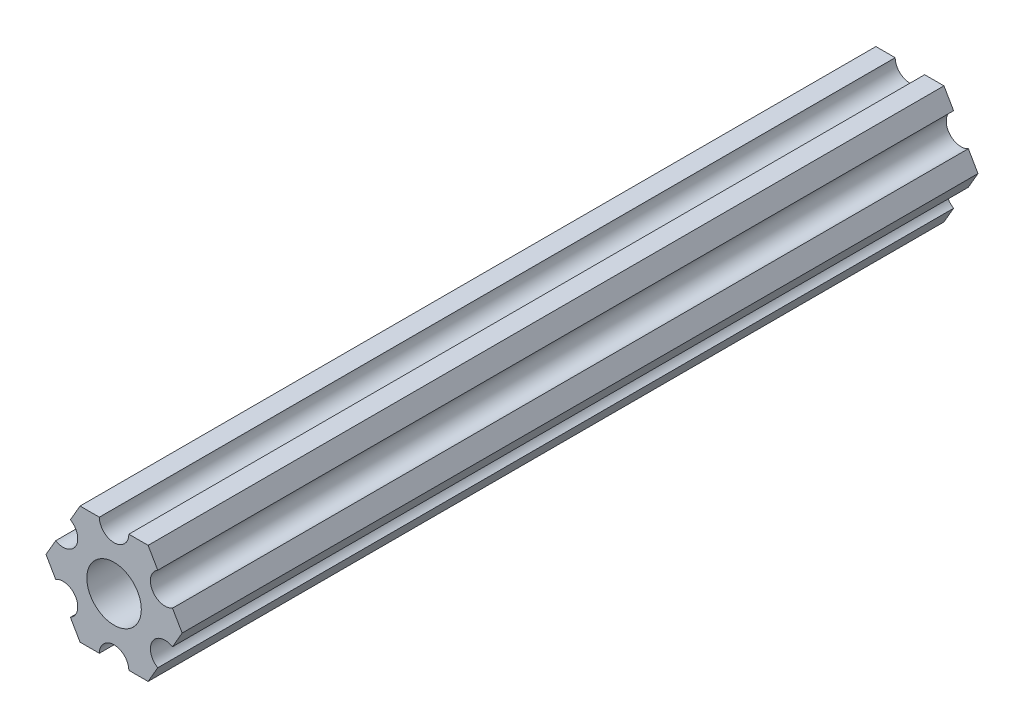
ISO-10303-21;
HEADER;
FILE_DESCRIPTION(('STEP AP214'),'2;1');
FILE_NAME('part.step','',(''),(''),'','','');
FILE_SCHEMA(('AUTOMOTIVE_DESIGN { 1 0 10303 214 1 1 1 1 }'));
ENDSEC;
DATA;
#1=APPLICATION_CONTEXT('core data for automotive mechanical design processes');
#2=APPLICATION_PROTOCOL_DEFINITION('international standard','automotive_design',2000,#1);
#3=PRODUCT_CONTEXT('',#1,'mechanical');
#4=PRODUCT('Part','Part','',(#3));
#5=PRODUCT_RELATED_PRODUCT_CATEGORY('part','',(#4));
#6=PRODUCT_DEFINITION_FORMATION('','',#4);
#7=PRODUCT_DEFINITION_CONTEXT('part definition',#1,'design');
#8=PRODUCT_DEFINITION('design','',#6,#7);
#9=PRODUCT_DEFINITION_SHAPE('','',#8);
#10=(LENGTH_UNIT() NAMED_UNIT(*) SI_UNIT(.MILLI.,.METRE.));
#11=(NAMED_UNIT(*) PLANE_ANGLE_UNIT() SI_UNIT($,.RADIAN.));
#12=(NAMED_UNIT(*) SI_UNIT($,.STERADIAN.) SOLID_ANGLE_UNIT());
#13=UNCERTAINTY_MEASURE_WITH_UNIT(LENGTH_MEASURE(1.E-05),#10,'distance_accuracy_value','');
#14=(GEOMETRIC_REPRESENTATION_CONTEXT(3) GLOBAL_UNCERTAINTY_ASSIGNED_CONTEXT((#13)) GLOBAL_UNIT_ASSIGNED_CONTEXT((#10,
#11,#12)) REPRESENTATION_CONTEXT('',''));
#15=CARTESIAN_POINT('',(0.,0.,0.));
#16=DIRECTION('',(0.,0.,1.));
#17=DIRECTION('',(1.,0.,0.));
#18=AXIS2_PLACEMENT_3D('',#15,#16,#17);
#19=CARTESIAN_POINT('',(5.49926112168156,3.17500033315933,85.725));
#20=DIRECTION('',(0.,0.,1.));
#21=DIRECTION('',(1.,0.,0.));
#22=AXIS2_PLACEMENT_3D('',#19,#20,#21);
#23=PLANE('',#22);
#24=DIRECTION('',(0.499999947533953,0.866025434075723,0.));
#25=VECTOR('',#24,1.);
#26=CARTESIAN_POINT('',(6.29301142309098,-1.80018429024546,85.725));
#27=LINE('',#26,#25);
#28=CARTESIAN_POINT('',(6.29301142309098,-1.80018429024546,85.725));
#29=VERTEX_POINT('',#28);
#30=CARTESIAN_POINT('',(7.33234841870826,4.44212519169686E-07,85.725));
#31=VERTEX_POINT('',#30);
#32=EDGE_CURVE('E226',#29,#31,#27,.T.);
#33=ORIENTED_EDGE('',*,*,#32,.T.);
#34=DIRECTION('',(-0.500000052466056,0.866025373493145,0.));
#35=VECTOR('',#34,1.);
#36=CARTESIAN_POINT('',(7.33234841870826,4.44212519169686E-07,85.725));
#37=LINE('',#36,#35);
#38=CARTESIAN_POINT('',(6.29301120497139,1.80018505273894,85.725));
#39=VERTEX_POINT('',#38);
#40=EDGE_CURVE('E124',#31,#39,#37,.T.);
#41=ORIENTED_EDGE('',*,*,#40,.T.);
#42=CARTESIAN_POINT('',(5.49926112168156,3.17500033315933,85.725));
#43=DIRECTION('',(0.,0.,-1.));
#44=DIRECTION('',(1.,0.,0.));
#45=AXIS2_PLACEMENT_3D('',#42,#43,#44);
#46=CIRCLE('',#45,1.5875);
#47=CARTESIAN_POINT('',(4.70551103839172,4.54981561357972,85.725));
#48=VERTEX_POINT('',#47);
#49=EDGE_CURVE('E271',#39,#48,#46,.T.);
#50=ORIENTED_EDGE('',*,*,#49,.T.);
#51=DIRECTION('',(-0.500000052466046,0.866025373493151,0.));
#52=VECTOR('',#51,1.);
#53=CARTESIAN_POINT('',(4.70551103839172,4.54981561357972,85.725));
#54=LINE('',#53,#52);
#55=CARTESIAN_POINT('',(3.66617382465481,6.35000022210627,85.725));
#56=VERTEX_POINT('',#55);
#57=EDGE_CURVE('E290',#48,#56,#54,.T.);
#58=ORIENTED_EDGE('',*,*,#57,.T.);
#59=DIRECTION('',(-0.999999999999998,-6.05825850611185E-08,0.));
#60=VECTOR('',#59,1.);
#61=CARTESIAN_POINT('',(3.66617382465481,6.35000022210627,85.725));
#62=LINE('',#61,#60);
#63=CARTESIAN_POINT('',(1.58749961530074,6.35000009617482,85.725));
#64=VERTEX_POINT('',#63);
#65=EDGE_CURVE('E287',#56,#64,#62,.T.);
#66=ORIENTED_EDGE('',*,*,#65,.T.);
#67=CARTESIAN_POINT('',(-3.84699260060323E-07,6.35,85.725));
#68=DIRECTION('',(0.,0.,-1.));
#69=DIRECTION('',(1.,0.,0.));
#70=AXIS2_PLACEMENT_3D('',#67,#68,#69);
#71=CIRCLE('',#70,1.5875);
#72=CARTESIAN_POINT('',(-1.58750038469926,6.34999990382518,85.725));
#73=VERTEX_POINT('',#72);
#74=EDGE_CURVE('E289',#64,#73,#71,.T.);
#75=ORIENTED_EDGE('',*,*,#74,.T.);
#76=DIRECTION('',(-0.999999999999998,-6.05825963273174E-08,0.));
#77=VECTOR('',#76,1.);
#78=CARTESIAN_POINT('',(-1.58750038469926,6.34999990382518,85.725));
#79=LINE('',#78,#77);
#80=CARTESIAN_POINT('',(-3.66617459405349,6.3499997778937,85.725));
#81=VERTEX_POINT('',#80);
#82=EDGE_CURVE('E292',#73,#81,#79,.T.);
#83=ORIENTED_EDGE('',*,*,#82,.T.);
#84=DIRECTION('',(-0.499999947533942,-0.866025434075729,0.));
#85=VECTOR('',#84,1.);
#86=CARTESIAN_POINT('',(-3.66617459405349,6.3499997778937,85.725));
#87=LINE('',#86,#85);
#88=CARTESIAN_POINT('',(-4.70551158967065,4.54981504343587,85.725));
#89=VERTEX_POINT('',#88);
#90=EDGE_CURVE('E298',#81,#89,#87,.T.);
#91=ORIENTED_EDGE('',*,*,#90,.T.);
#92=CARTESIAN_POINT('',(-5.49926150638082,3.17499966684067,85.725));
#93=DIRECTION('',(0.,0.,-1.));
#94=DIRECTION('',(1.,0.,0.));
#95=AXIS2_PLACEMENT_3D('',#92,#93,#94);
#96=CIRCLE('',#95,1.5875);
#97=CARTESIAN_POINT('',(-6.29301142309098,1.80018429024547,85.725));
#98=VERTEX_POINT('',#97);
#99=EDGE_CURVE('E300',#89,#98,#96,.T.);
#100=ORIENTED_EDGE('',*,*,#99,.T.);
#101=DIRECTION('',(-0.499999947533951,-0.866025434075724,0.));
#102=VECTOR('',#101,1.);
#103=CARTESIAN_POINT('',(-6.29301142309098,1.80018429024547,85.725));
#104=LINE('',#103,#102);
#105=CARTESIAN_POINT('',(-7.33234841870826,-4.44212523790841E-07,85.725));
#106=VERTEX_POINT('',#105);
#107=EDGE_CURVE('E302',#98,#106,#104,.T.);
#108=ORIENTED_EDGE('',*,*,#107,.T.);
#109=DIRECTION('',(0.500000052466045,-0.866025373493151,0.));
#110=VECTOR('',#109,1.);
#111=CARTESIAN_POINT('',(-7.33234841870826,-4.44212523790841E-07,85.725));
#112=LINE('',#111,#110);
#113=CARTESIAN_POINT('',(-6.29301120497141,-1.80018505273897,85.725));
#114=VERTEX_POINT('',#113);
#115=EDGE_CURVE('E304',#106,#114,#112,.T.);
#116=ORIENTED_EDGE('',*,*,#115,.T.);
#117=CARTESIAN_POINT('',(-5.49926112168156,-3.17500033315934,85.725));
#118=DIRECTION('',(0.,0.,-1.));
#119=DIRECTION('',(1.,0.,0.));
#120=AXIS2_PLACEMENT_3D('',#117,#118,#119);
#121=CIRCLE('',#120,1.5875);
#122=CARTESIAN_POINT('',(-4.70551103839172,-4.54981561357972,85.725));
#123=VERTEX_POINT('',#122);
#124=EDGE_CURVE('E306',#114,#123,#121,.T.);
#125=ORIENTED_EDGE('',*,*,#124,.T.);
#126=DIRECTION('',(0.500000052466045,-0.866025373493151,0.));
#127=VECTOR('',#126,1.);
#128=CARTESIAN_POINT('',(-4.70551103839172,-4.54981561357972,85.725));
#129=LINE('',#128,#127);
#130=CARTESIAN_POINT('',(-3.66617382465481,-6.35000022210628,85.725));
#131=VERTEX_POINT('',#130);
#132=EDGE_CURVE('E308',#123,#131,#129,.T.);
#133=ORIENTED_EDGE('',*,*,#132,.T.);
#134=DIRECTION('',(0.999999999999998,6.05825854783851E-08,0.));
#135=VECTOR('',#134,1.);
#136=CARTESIAN_POINT('',(-3.66617382465481,-6.35000022210628,85.725));
#137=LINE('',#136,#135);
#138=CARTESIAN_POINT('',(-1.58749961530074,-6.35000009617482,85.725));
#139=VERTEX_POINT('',#138);
#140=EDGE_CURVE('E310',#131,#139,#137,.T.);
#141=ORIENTED_EDGE('',*,*,#140,.T.);
#142=CARTESIAN_POINT('',(3.8469926204343E-07,-6.35,85.725));
#143=DIRECTION('',(0.,0.,-1.));
#144=DIRECTION('',(1.,0.,0.));
#145=AXIS2_PLACEMENT_3D('',#142,#143,#144);
#146=CIRCLE('',#145,1.5875);
#147=CARTESIAN_POINT('',(1.58750038469926,-6.34999990382518,85.725));
#148=VERTEX_POINT('',#147);
#149=EDGE_CURVE('E173',#139,#148,#146,.T.);
#150=ORIENTED_EDGE('',*,*,#149,.T.);
#151=DIRECTION('',(0.999999999999998,6.05825721258438E-08,0.));
#152=VECTOR('',#151,1.);
#153=CARTESIAN_POINT('',(1.58750038469926,-6.34999990382518,85.725));
#154=LINE('',#153,#152);
#155=CARTESIAN_POINT('',(3.66617459405346,-6.34999977789375,85.725));
#156=VERTEX_POINT('',#155);
#157=EDGE_CURVE('E167',#148,#156,#154,.T.);
#158=ORIENTED_EDGE('',*,*,#157,.T.);
#159=DIRECTION('',(0.499999947533941,0.86602543407573,0.));
#160=VECTOR('',#159,1.);
#161=CARTESIAN_POINT('',(3.66617459405346,-6.34999977789375,85.725));
#162=LINE('',#161,#160);
#163=CARTESIAN_POINT('',(4.70551158967065,-4.54981504343587,85.725));
#164=VERTEX_POINT('',#163);
#165=EDGE_CURVE('E171',#156,#164,#162,.T.);
#166=ORIENTED_EDGE('',*,*,#165,.T.);
#167=CARTESIAN_POINT('',(5.49926150638082,-3.17499966684067,85.725));
#168=DIRECTION('',(0.,0.,-1.));
#169=DIRECTION('',(1.,0.,0.));
#170=AXIS2_PLACEMENT_3D('',#167,#168,#169);
#171=CIRCLE('',#170,1.58750000000001);
#172=EDGE_CURVE('E51',#164,#29,#171,.T.);
#173=ORIENTED_EDGE('',*,*,#172,.T.);
#174=EDGE_LOOP('',(#33,#41,#50,#58,#66,#75,#83,#91,#100,#108,#116,#125,#133,#141,#150,#158,#166,#173));
#175=FACE_BOUND('',#174,.T.);
#176=CARTESIAN_POINT('',(0.,0.,85.725));
#177=DIRECTION('',(0.,0.,1.));
#178=DIRECTION('',(1.,0.,0.));
#179=AXIS2_PLACEMENT_3D('',#176,#177,#178);
#180=CIRCLE('',#179,2.9337);
#181=CARTESIAN_POINT('',(2.9337,0.,85.725));
#182=VERTEX_POINT('',#181);
#183=EDGE_CURVE('E195',#182,#182,#180,.T.);
#184=ORIENTED_EDGE('',*,*,#183,.F.);
#185=EDGE_LOOP('',(#184));
#186=FACE_BOUND('',#185,.T.);
#187=ADVANCED_FACE('F34',(#175,#186),#23,.T.);
#188=CARTESIAN_POINT('',(5.49926112168156,3.17500033315933,0.));
#189=DIRECTION('',(0.,0.,1.));
#190=DIRECTION('',(1.,0.,0.));
#191=AXIS2_PLACEMENT_3D('',#188,#189,#190);
#192=PLANE('',#191);
#193=DIRECTION('',(0.499999947533953,0.866025434075723,0.));
#194=VECTOR('',#193,1.);
#195=CARTESIAN_POINT('',(6.29301142309098,-1.80018429024546,0.));
#196=LINE('',#195,#194);
#197=CARTESIAN_POINT('',(6.29301142309098,-1.80018429024546,0.));
#198=VERTEX_POINT('',#197);
#199=CARTESIAN_POINT('',(7.33234841870826,4.44212519169686E-07,0.));
#200=VERTEX_POINT('',#199);
#201=EDGE_CURVE('E191',#198,#200,#196,.T.);
#202=ORIENTED_EDGE('',*,*,#201,.F.);
#203=CARTESIAN_POINT('',(5.49926150638082,-3.17499966684067,0.));
#204=DIRECTION('',(0.,0.,-1.));
#205=DIRECTION('',(1.,0.,0.));
#206=AXIS2_PLACEMENT_3D('',#203,#204,#205);
#207=CIRCLE('',#206,1.58750000000001);
#208=CARTESIAN_POINT('',(4.70551158967065,-4.54981504343587,0.));
#209=VERTEX_POINT('',#208);
#210=EDGE_CURVE('E116',#209,#198,#207,.T.);
#211=ORIENTED_EDGE('',*,*,#210,.F.);
#212=DIRECTION('',(0.499999947533941,0.86602543407573,0.));
#213=VECTOR('',#212,1.);
#214=CARTESIAN_POINT('',(3.66617459405346,-6.34999977789375,0.));
#215=LINE('',#214,#213);
#216=CARTESIAN_POINT('',(3.66617459405346,-6.34999977789375,0.));
#217=VERTEX_POINT('',#216);
#218=EDGE_CURVE('E110',#217,#209,#215,.T.);
#219=ORIENTED_EDGE('',*,*,#218,.F.);
#220=DIRECTION('',(0.999999999999998,6.05825721258438E-08,0.));
#221=VECTOR('',#220,1.);
#222=CARTESIAN_POINT('',(1.58750038469926,-6.34999990382518,0.));
#223=LINE('',#222,#221);
#224=CARTESIAN_POINT('',(1.58750038469926,-6.34999990382518,0.));
#225=VERTEX_POINT('',#224);
#226=EDGE_CURVE('E181',#225,#217,#223,.T.);
#227=ORIENTED_EDGE('',*,*,#226,.F.);
#228=CARTESIAN_POINT('',(3.8469926204343E-07,-6.35,0.));
#229=DIRECTION('',(0.,0.,-1.));
#230=DIRECTION('',(1.,0.,0.));
#231=AXIS2_PLACEMENT_3D('',#228,#229,#230);
#232=CIRCLE('',#231,1.5875);
#233=CARTESIAN_POINT('',(-1.58749961530074,-6.35000009617482,0.));
#234=VERTEX_POINT('',#233);
#235=EDGE_CURVE('E221',#234,#225,#232,.T.);
#236=ORIENTED_EDGE('',*,*,#235,.F.);
#237=DIRECTION('',(0.999999999999998,6.05825854783851E-08,0.));
#238=VECTOR('',#237,1.);
#239=CARTESIAN_POINT('',(-3.66617382465481,-6.35000022210628,0.));
#240=LINE('',#239,#238);
#241=CARTESIAN_POINT('',(-3.66617382465481,-6.35000022210628,0.));
#242=VERTEX_POINT('',#241);
#243=EDGE_CURVE('E219',#242,#234,#240,.T.);
#244=ORIENTED_EDGE('',*,*,#243,.F.);
#245=DIRECTION('',(0.500000052466045,-0.866025373493151,0.));
#246=VECTOR('',#245,1.);
#247=CARTESIAN_POINT('',(-4.70551103839172,-4.54981561357972,0.));
#248=LINE('',#247,#246);
#249=CARTESIAN_POINT('',(-4.70551103839172,-4.54981561357972,0.));
#250=VERTEX_POINT('',#249);
#251=EDGE_CURVE('E217',#250,#242,#248,.T.);
#252=ORIENTED_EDGE('',*,*,#251,.F.);
#253=CARTESIAN_POINT('',(-5.49926112168156,-3.17500033315934,0.));
#254=DIRECTION('',(0.,0.,-1.));
#255=DIRECTION('',(1.,0.,0.));
#256=AXIS2_PLACEMENT_3D('',#253,#254,#255);
#257=CIRCLE('',#256,1.5875);
#258=CARTESIAN_POINT('',(-6.29301120497141,-1.80018505273897,0.));
#259=VERTEX_POINT('',#258);
#260=EDGE_CURVE('E215',#259,#250,#257,.T.);
#261=ORIENTED_EDGE('',*,*,#260,.F.);
#262=DIRECTION('',(0.500000052466045,-0.866025373493151,0.));
#263=VECTOR('',#262,1.);
#264=CARTESIAN_POINT('',(-7.33234841870826,-4.44212523790841E-07,0.));
#265=LINE('',#264,#263);
#266=CARTESIAN_POINT('',(-7.33234841870826,-4.44212523790841E-07,0.));
#267=VERTEX_POINT('',#266);
#268=EDGE_CURVE('E213',#267,#259,#265,.T.);
#269=ORIENTED_EDGE('',*,*,#268,.F.);
#270=DIRECTION('',(-0.499999947533951,-0.866025434075724,0.));
#271=VECTOR('',#270,1.);
#272=CARTESIAN_POINT('',(-6.29301142309098,1.80018429024547,0.));
#273=LINE('',#272,#271);
#274=CARTESIAN_POINT('',(-6.29301142309098,1.80018429024547,0.));
#275=VERTEX_POINT('',#274);
#276=EDGE_CURVE('E211',#275,#267,#273,.T.);
#277=ORIENTED_EDGE('',*,*,#276,.F.);
#278=CARTESIAN_POINT('',(-5.49926150638082,3.17499966684067,0.));
#279=DIRECTION('',(0.,0.,-1.));
#280=DIRECTION('',(1.,0.,0.));
#281=AXIS2_PLACEMENT_3D('',#278,#279,#280);
#282=CIRCLE('',#281,1.5875);
#283=CARTESIAN_POINT('',(-4.70551158967065,4.54981504343587,0.));
#284=VERTEX_POINT('',#283);
#285=EDGE_CURVE('E209',#284,#275,#282,.T.);
#286=ORIENTED_EDGE('',*,*,#285,.F.);
#287=DIRECTION('',(-0.499999947533942,-0.866025434075729,0.));
#288=VECTOR('',#287,1.);
#289=CARTESIAN_POINT('',(-3.66617459405349,6.3499997778937,0.));
#290=LINE('',#289,#288);
#291=CARTESIAN_POINT('',(-3.66617459405349,6.3499997778937,0.));
#292=VERTEX_POINT('',#291);
#293=EDGE_CURVE('E207',#292,#284,#290,.T.);
#294=ORIENTED_EDGE('',*,*,#293,.F.);
#295=DIRECTION('',(-0.999999999999998,-6.05825963273174E-08,0.));
#296=VECTOR('',#295,1.);
#297=CARTESIAN_POINT('',(-1.58750038469926,6.34999990382518,0.));
#298=LINE('',#297,#296);
#299=CARTESIAN_POINT('',(-1.58750038469926,6.34999990382518,0.));
#300=VERTEX_POINT('',#299);
#301=EDGE_CURVE('E205',#300,#292,#298,.T.);
#302=ORIENTED_EDGE('',*,*,#301,.F.);
#303=CARTESIAN_POINT('',(-3.84699260060323E-07,6.35,0.));
#304=DIRECTION('',(0.,0.,-1.));
#305=DIRECTION('',(1.,0.,0.));
#306=AXIS2_PLACEMENT_3D('',#303,#304,#305);
#307=CIRCLE('',#306,1.5875);
#308=CARTESIAN_POINT('',(1.58749961530074,6.35000009617482,0.));
#309=VERTEX_POINT('',#308);
#310=EDGE_CURVE('E203',#309,#300,#307,.T.);
#311=ORIENTED_EDGE('',*,*,#310,.F.);
#312=DIRECTION('',(-0.999999999999998,-6.05825850611185E-08,0.));
#313=VECTOR('',#312,1.);
#314=CARTESIAN_POINT('',(3.66617382465481,6.35000022210627,0.));
#315=LINE('',#314,#313);
#316=CARTESIAN_POINT('',(3.66617382465481,6.35000022210627,0.));
#317=VERTEX_POINT('',#316);
#318=EDGE_CURVE('E201',#317,#309,#315,.T.);
#319=ORIENTED_EDGE('',*,*,#318,.F.);
#320=DIRECTION('',(-0.500000052466046,0.866025373493151,0.));
#321=VECTOR('',#320,1.);
#322=CARTESIAN_POINT('',(4.70551103839172,4.54981561357972,0.));
#323=LINE('',#322,#321);
#324=CARTESIAN_POINT('',(4.70551103839172,4.54981561357972,0.));
#325=VERTEX_POINT('',#324);
#326=EDGE_CURVE('E199',#325,#317,#323,.T.);
#327=ORIENTED_EDGE('',*,*,#326,.F.);
#328=CARTESIAN_POINT('',(5.49926112168156,3.17500033315933,0.));
#329=DIRECTION('',(0.,0.,-1.));
#330=DIRECTION('',(1.,0.,0.));
#331=AXIS2_PLACEMENT_3D('',#328,#329,#330);
#332=CIRCLE('',#331,1.5875);
#333=CARTESIAN_POINT('',(6.29301120497139,1.80018505273894,0.));
#334=VERTEX_POINT('',#333);
#335=EDGE_CURVE('E197',#334,#325,#332,.T.);
#336=ORIENTED_EDGE('',*,*,#335,.F.);
#337=DIRECTION('',(-0.500000052466056,0.866025373493145,0.));
#338=VECTOR('',#337,1.);
#339=CARTESIAN_POINT('',(7.33234841870826,4.44212519169686E-07,0.));
#340=LINE('',#339,#338);
#341=EDGE_CURVE('E194',#200,#334,#340,.T.);
#342=ORIENTED_EDGE('',*,*,#341,.F.);
#343=EDGE_LOOP('',(#202,#211,#219,#227,#236,#244,#252,#261,#269,#277,#286,#294,#302,#311,#319,
#327,#336,#342));
#344=FACE_BOUND('',#343,.T.);
#345=CARTESIAN_POINT('',(0.,0.,0.));
#346=DIRECTION('',(0.,0.,1.));
#347=DIRECTION('',(1.,0.,0.));
#348=AXIS2_PLACEMENT_3D('',#345,#346,#347);
#349=CIRCLE('',#348,2.9337);
#350=CARTESIAN_POINT('',(2.9337,0.,0.));
#351=VERTEX_POINT('',#350);
#352=EDGE_CURVE('E535',#351,#351,#349,.T.);
#353=ORIENTED_EDGE('',*,*,#352,.T.);
#354=EDGE_LOOP('',(#353));
#355=FACE_BOUND('',#354,.T.);
#356=ADVANCED_FACE('F275',(#344,#355),#192,.F.);
#357=CARTESIAN_POINT('',(6.29301142309098,-1.80018429024546,85.725));
#358=DIRECTION('',(-0.866025434075723,0.499999947533953,0.));
#359=DIRECTION('',(-0.499999947533953,-0.866025434075723,0.));
#360=AXIS2_PLACEMENT_3D('',#357,#358,#359);
#361=PLANE('',#360);
#362=ORIENTED_EDGE('',*,*,#201,.T.);
#363=DIRECTION('',(0.,0.,-1.));
#364=VECTOR('',#363,1.);
#365=CARTESIAN_POINT('',(7.33234841870826,4.44212519169686E-07,85.725));
#366=LINE('',#365,#364);
#367=EDGE_CURVE('E11',#31,#200,#366,.T.);
#368=ORIENTED_EDGE('',*,*,#367,.F.);
#369=ORIENTED_EDGE('',*,*,#32,.F.);
#370=DIRECTION('',(0.,0.,-1.));
#371=VECTOR('',#370,1.);
#372=CARTESIAN_POINT('',(6.29301142309098,-1.80018429024546,85.725));
#373=LINE('',#372,#371);
#374=EDGE_CURVE('E187',#29,#198,#373,.T.);
#375=ORIENTED_EDGE('',*,*,#374,.T.);
#376=EDGE_LOOP('',(#362,#368,#369,#375));
#377=FACE_BOUND('',#376,.T.);
#378=ADVANCED_FACE('F36',(#377),#361,.F.);
#379=CARTESIAN_POINT('',(7.33234841870826,4.44212519169686E-07,85.725));
#380=DIRECTION('',(-0.866025373493145,-0.500000052466056,0.));
#381=DIRECTION('',(0.500000052466056,-0.866025373493145,0.));
#382=AXIS2_PLACEMENT_3D('',#379,#380,#381);
#383=PLANE('',#382);
#384=ORIENTED_EDGE('',*,*,#341,.T.);
#385=DIRECTION('',(0.,0.,-1.));
#386=VECTOR('',#385,1.);
#387=CARTESIAN_POINT('',(6.29301120497139,1.80018505273894,85.725));
#388=LINE('',#387,#386);
#389=EDGE_CURVE('E43',#39,#334,#388,.T.);
#390=ORIENTED_EDGE('',*,*,#389,.F.);
#391=ORIENTED_EDGE('',*,*,#40,.F.);
#392=ORIENTED_EDGE('',*,*,#367,.T.);
#393=EDGE_LOOP('',(#384,#390,#391,#392));
#394=FACE_BOUND('',#393,.T.);
#395=ADVANCED_FACE('F344',(#394),#383,.F.);
#396=CARTESIAN_POINT('',(5.49926112168156,3.17500033315933,85.725));
#397=DIRECTION('',(0.,0.,-1.));
#398=DIRECTION('',(-1.,0.,0.));
#399=AXIS2_PLACEMENT_3D('',#396,#397,#398);
#400=CYLINDRICAL_SURFACE('',#399,1.5875);
#401=ORIENTED_EDGE('',*,*,#335,.T.);
#402=DIRECTION('',(0.,0.,-1.));
#403=VECTOR('',#402,1.);
#404=CARTESIAN_POINT('',(4.70551103839172,4.54981561357972,85.725));
#405=LINE('',#404,#403);
#406=EDGE_CURVE('E263',#48,#325,#405,.T.);
#407=ORIENTED_EDGE('',*,*,#406,.F.);
#408=ORIENTED_EDGE('',*,*,#49,.F.);
#409=ORIENTED_EDGE('',*,*,#389,.T.);
#410=EDGE_LOOP('',(#401,#407,#408,#409));
#411=FACE_BOUND('',#410,.T.);
#412=ADVANCED_FACE('F269',(#411),#400,.F.);
#413=CARTESIAN_POINT('',(4.70551103839172,4.54981561357972,85.725));
#414=DIRECTION('',(-0.866025373493151,-0.500000052466046,0.));
#415=DIRECTION('',(0.500000052466046,-0.866025373493151,0.));
#416=AXIS2_PLACEMENT_3D('',#413,#414,#415);
#417=PLANE('',#416);
#418=ORIENTED_EDGE('',*,*,#326,.T.);
#419=DIRECTION('',(0.,0.,-1.));
#420=VECTOR('',#419,1.);
#421=CARTESIAN_POINT('',(3.66617382465481,6.35000022210627,85.725));
#422=LINE('',#421,#420);
#423=EDGE_CURVE('E260',#56,#317,#422,.T.);
#424=ORIENTED_EDGE('',*,*,#423,.F.);
#425=ORIENTED_EDGE('',*,*,#57,.F.);
#426=ORIENTED_EDGE('',*,*,#406,.T.);
#427=EDGE_LOOP('',(#418,#424,#425,#426));
#428=FACE_BOUND('',#427,.T.);
#429=ADVANCED_FACE('F281',(#428),#417,.F.);
#430=CARTESIAN_POINT('',(3.66617382465481,6.35000022210627,85.725));
#431=DIRECTION('',(6.05825850611185E-08,-0.999999999999998,0.));
#432=DIRECTION('',(0.999999999999998,6.05825850611185E-08,0.));
#433=AXIS2_PLACEMENT_3D('',#430,#431,#432);
#434=PLANE('',#433);
#435=ORIENTED_EDGE('',*,*,#318,.T.);
#436=DIRECTION('',(0.,0.,-1.));
#437=VECTOR('',#436,1.);
#438=CARTESIAN_POINT('',(1.58749961530074,6.35000009617482,85.725));
#439=LINE('',#438,#437);
#440=EDGE_CURVE('E257',#64,#309,#439,.T.);
#441=ORIENTED_EDGE('',*,*,#440,.F.);
#442=ORIENTED_EDGE('',*,*,#65,.F.);
#443=ORIENTED_EDGE('',*,*,#423,.T.);
#444=EDGE_LOOP('',(#435,#441,#442,#443));
#445=FACE_BOUND('',#444,.T.);
#446=ADVANCED_FACE('F285',(#445),#434,.F.);
#447=CARTESIAN_POINT('',(-3.84699260060323E-07,6.35,85.725));
#448=DIRECTION('',(0.,0.,-1.));
#449=DIRECTION('',(-1.,0.,0.));
#450=AXIS2_PLACEMENT_3D('',#447,#448,#449);
#451=CYLINDRICAL_SURFACE('',#450,1.5875);
#452=ORIENTED_EDGE('',*,*,#310,.T.);
#453=DIRECTION('',(0.,0.,-1.));
#454=VECTOR('',#453,1.);
#455=CARTESIAN_POINT('',(-1.58750038469926,6.34999990382518,85.725));
#456=LINE('',#455,#454);
#457=EDGE_CURVE('E254',#73,#300,#456,.T.);
#458=ORIENTED_EDGE('',*,*,#457,.F.);
#459=ORIENTED_EDGE('',*,*,#74,.F.);
#460=ORIENTED_EDGE('',*,*,#440,.T.);
#461=EDGE_LOOP('',(#452,#458,#459,#460));
#462=FACE_BOUND('',#461,.T.);
#463=ADVANCED_FACE('F357',(#462),#451,.F.);
#464=CARTESIAN_POINT('',(-1.58750038469926,6.34999990382518,85.725));
#465=DIRECTION('',(6.05825963273174E-08,-0.999999999999998,0.));
#466=DIRECTION('',(0.999999999999998,6.05825963273174E-08,0.));
#467=AXIS2_PLACEMENT_3D('',#464,#465,#466);
#468=PLANE('',#467);
#469=ORIENTED_EDGE('',*,*,#301,.T.);
#470=DIRECTION('',(0.,0.,-1.));
#471=VECTOR('',#470,1.);
#472=CARTESIAN_POINT('',(-3.66617459405349,6.3499997778937,85.725));
#473=LINE('',#472,#471);
#474=EDGE_CURVE('E251',#81,#292,#473,.T.);
#475=ORIENTED_EDGE('',*,*,#474,.F.);
#476=ORIENTED_EDGE('',*,*,#82,.F.);
#477=ORIENTED_EDGE('',*,*,#457,.T.);
#478=EDGE_LOOP('',(#469,#475,#476,#477));
#479=FACE_BOUND('',#478,.T.);
#480=ADVANCED_FACE('F360',(#479),#468,.F.);
#481=CARTESIAN_POINT('',(-3.66617459405349,6.3499997778937,85.725));
#482=DIRECTION('',(0.866025434075729,-0.499999947533942,0.));
#483=DIRECTION('',(0.499999947533942,0.866025434075729,0.));
#484=AXIS2_PLACEMENT_3D('',#481,#482,#483);
#485=PLANE('',#484);
#486=ORIENTED_EDGE('',*,*,#293,.T.);
#487=DIRECTION('',(0.,0.,-1.));
#488=VECTOR('',#487,1.);
#489=CARTESIAN_POINT('',(-4.70551158967065,4.54981504343587,85.725));
#490=LINE('',#489,#488);
#491=EDGE_CURVE('E248',#89,#284,#490,.T.);
#492=ORIENTED_EDGE('',*,*,#491,.F.);
#493=ORIENTED_EDGE('',*,*,#90,.F.);
#494=ORIENTED_EDGE('',*,*,#474,.T.);
#495=EDGE_LOOP('',(#486,#492,#493,#494));
#496=FACE_BOUND('',#495,.T.);
#497=ADVANCED_FACE('F364',(#496),#485,.F.);
#498=CARTESIAN_POINT('',(-5.49926150638082,3.17499966684067,85.725));
#499=DIRECTION('',(0.,0.,-1.));
#500=DIRECTION('',(-1.,0.,0.));
#501=AXIS2_PLACEMENT_3D('',#498,#499,#500);
#502=CYLINDRICAL_SURFACE('',#501,1.5875);
#503=ORIENTED_EDGE('',*,*,#285,.T.);
#504=DIRECTION('',(0.,0.,-1.));
#505=VECTOR('',#504,1.);
#506=CARTESIAN_POINT('',(-6.29301142309098,1.80018429024547,85.725));
#507=LINE('',#506,#505);
#508=EDGE_CURVE('E245',#98,#275,#507,.T.);
#509=ORIENTED_EDGE('',*,*,#508,.F.);
#510=ORIENTED_EDGE('',*,*,#99,.F.);
#511=ORIENTED_EDGE('',*,*,#491,.T.);
#512=EDGE_LOOP('',(#503,#509,#510,#511));
#513=FACE_BOUND('',#512,.T.);
#514=ADVANCED_FACE('F368',(#513),#502,.F.);
#515=CARTESIAN_POINT('',(-6.29301142309098,1.80018429024547,85.725));
#516=DIRECTION('',(0.866025434075724,-0.499999947533951,0.));
#517=DIRECTION('',(0.499999947533951,0.866025434075724,0.));
#518=AXIS2_PLACEMENT_3D('',#515,#516,#517);
#519=PLANE('',#518);
#520=ORIENTED_EDGE('',*,*,#276,.T.);
#521=DIRECTION('',(0.,0.,-1.));
#522=VECTOR('',#521,1.);
#523=CARTESIAN_POINT('',(-7.33234841870826,-4.44212523790841E-07,85.725));
#524=LINE('',#523,#522);
#525=EDGE_CURVE('E242',#106,#267,#524,.T.);
#526=ORIENTED_EDGE('',*,*,#525,.F.);
#527=ORIENTED_EDGE('',*,*,#107,.F.);
#528=ORIENTED_EDGE('',*,*,#508,.T.);
#529=EDGE_LOOP('',(#520,#526,#527,#528));
#530=FACE_BOUND('',#529,.T.);
#531=ADVANCED_FACE('F372',(#530),#519,.F.);
#532=CARTESIAN_POINT('',(-7.33234841870826,-4.44212523790841E-07,85.725));
#533=DIRECTION('',(0.866025373493151,0.500000052466045,0.));
#534=DIRECTION('',(-0.500000052466045,0.866025373493151,0.));
#535=AXIS2_PLACEMENT_3D('',#532,#533,#534);
#536=PLANE('',#535);
#537=ORIENTED_EDGE('',*,*,#268,.T.);
#538=DIRECTION('',(0.,0.,-1.));
#539=VECTOR('',#538,1.);
#540=CARTESIAN_POINT('',(-6.29301120497141,-1.80018505273897,85.725));
#541=LINE('',#540,#539);
#542=EDGE_CURVE('E239',#114,#259,#541,.T.);
#543=ORIENTED_EDGE('',*,*,#542,.F.);
#544=ORIENTED_EDGE('',*,*,#115,.F.);
#545=ORIENTED_EDGE('',*,*,#525,.T.);
#546=EDGE_LOOP('',(#537,#543,#544,#545));
#547=FACE_BOUND('',#546,.T.);
#548=ADVANCED_FACE('F376',(#547),#536,.F.);
#549=CARTESIAN_POINT('',(-5.49926112168156,-3.17500033315934,85.725));
#550=DIRECTION('',(0.,0.,-1.));
#551=DIRECTION('',(-1.,0.,0.));
#552=AXIS2_PLACEMENT_3D('',#549,#550,#551);
#553=CYLINDRICAL_SURFACE('',#552,1.5875);
#554=ORIENTED_EDGE('',*,*,#260,.T.);
#555=DIRECTION('',(0.,0.,-1.));
#556=VECTOR('',#555,1.);
#557=CARTESIAN_POINT('',(-4.70551103839172,-4.54981561357972,85.725));
#558=LINE('',#557,#556);
#559=EDGE_CURVE('E236',#123,#250,#558,.T.);
#560=ORIENTED_EDGE('',*,*,#559,.F.);
#561=ORIENTED_EDGE('',*,*,#124,.F.);
#562=ORIENTED_EDGE('',*,*,#542,.T.);
#563=EDGE_LOOP('',(#554,#560,#561,#562));
#564=FACE_BOUND('',#563,.T.);
#565=ADVANCED_FACE('F380',(#564),#553,.F.);
#566=CARTESIAN_POINT('',(-4.70551103839172,-4.54981561357972,85.725));
#567=DIRECTION('',(0.866025373493151,0.500000052466045,0.));
#568=DIRECTION('',(-0.500000052466045,0.866025373493151,0.));
#569=AXIS2_PLACEMENT_3D('',#566,#567,#568);
#570=PLANE('',#569);
#571=ORIENTED_EDGE('',*,*,#251,.T.);
#572=DIRECTION('',(0.,0.,-1.));
#573=VECTOR('',#572,1.);
#574=CARTESIAN_POINT('',(-3.66617382465481,-6.35000022210628,85.725));
#575=LINE('',#574,#573);
#576=EDGE_CURVE('E233',#131,#242,#575,.T.);
#577=ORIENTED_EDGE('',*,*,#576,.F.);
#578=ORIENTED_EDGE('',*,*,#132,.F.);
#579=ORIENTED_EDGE('',*,*,#559,.T.);
#580=EDGE_LOOP('',(#571,#577,#578,#579));
#581=FACE_BOUND('',#580,.T.);
#582=ADVANCED_FACE('F384',(#581),#570,.F.);
#583=CARTESIAN_POINT('',(-3.66617382465481,-6.35000022210628,85.725));
#584=DIRECTION('',(-6.05825854783851E-08,0.999999999999998,0.));
#585=DIRECTION('',(-0.999999999999998,-6.05825854783851E-08,0.));
#586=AXIS2_PLACEMENT_3D('',#583,#584,#585);
#587=PLANE('',#586);
#588=ORIENTED_EDGE('',*,*,#243,.T.);
#589=DIRECTION('',(0.,0.,-1.));
#590=VECTOR('',#589,1.);
#591=CARTESIAN_POINT('',(-1.58749961530074,-6.35000009617482,85.725));
#592=LINE('',#591,#590);
#593=EDGE_CURVE('E230',#139,#234,#592,.T.);
#594=ORIENTED_EDGE('',*,*,#593,.F.);
#595=ORIENTED_EDGE('',*,*,#140,.F.);
#596=ORIENTED_EDGE('',*,*,#576,.T.);
#597=EDGE_LOOP('',(#588,#594,#595,#596));
#598=FACE_BOUND('',#597,.T.);
#599=ADVANCED_FACE('F316',(#598),#587,.F.);
#600=CARTESIAN_POINT('',(3.8469926204343E-07,-6.35,85.725));
#601=DIRECTION('',(0.,0.,-1.));
#602=DIRECTION('',(-1.,0.,0.));
#603=AXIS2_PLACEMENT_3D('',#600,#601,#602);
#604=CYLINDRICAL_SURFACE('',#603,1.5875);
#605=ORIENTED_EDGE('',*,*,#235,.T.);
#606=DIRECTION('',(0.,0.,-1.));
#607=VECTOR('',#606,1.);
#608=CARTESIAN_POINT('',(1.58750038469926,-6.34999990382518,85.725));
#609=LINE('',#608,#607);
#610=EDGE_CURVE('E182',#148,#225,#609,.T.);
#611=ORIENTED_EDGE('',*,*,#610,.F.);
#612=ORIENTED_EDGE('',*,*,#149,.F.);
#613=ORIENTED_EDGE('',*,*,#593,.T.);
#614=EDGE_LOOP('',(#605,#611,#612,#613));
#615=FACE_BOUND('',#614,.T.);
#616=ADVANCED_FACE('F320',(#615),#604,.F.);
#617=CARTESIAN_POINT('',(1.58750038469926,-6.34999990382518,85.725));
#618=DIRECTION('',(-6.05825721258438E-08,0.999999999999998,0.));
#619=DIRECTION('',(-0.999999999999998,-6.05825721258438E-08,0.));
#620=AXIS2_PLACEMENT_3D('',#617,#618,#619);
#621=PLANE('',#620);
#622=ORIENTED_EDGE('',*,*,#226,.T.);
#623=DIRECTION('',(0.,0.,-1.));
#624=VECTOR('',#623,1.);
#625=CARTESIAN_POINT('',(3.66617459405346,-6.34999977789375,85.725));
#626=LINE('',#625,#624);
#627=EDGE_CURVE('E178',#156,#217,#626,.T.);
#628=ORIENTED_EDGE('',*,*,#627,.F.);
#629=ORIENTED_EDGE('',*,*,#157,.F.);
#630=ORIENTED_EDGE('',*,*,#610,.T.);
#631=EDGE_LOOP('',(#622,#628,#629,#630));
#632=FACE_BOUND('',#631,.T.);
#633=ADVANCED_FACE('F179',(#632),#621,.F.);
#634=CARTESIAN_POINT('',(3.66617459405346,-6.34999977789375,85.725));
#635=DIRECTION('',(-0.86602543407573,0.499999947533941,0.));
#636=DIRECTION('',(-0.499999947533941,-0.86602543407573,0.));
#637=AXIS2_PLACEMENT_3D('',#634,#635,#636);
#638=PLANE('',#637);
#639=ORIENTED_EDGE('',*,*,#218,.T.);
#640=DIRECTION('',(0.,0.,-1.));
#641=VECTOR('',#640,1.);
#642=CARTESIAN_POINT('',(4.70551158967065,-4.54981504343587,85.725));
#643=LINE('',#642,#641);
#644=EDGE_CURVE('E183',#164,#209,#643,.T.);
#645=ORIENTED_EDGE('',*,*,#644,.F.);
#646=ORIENTED_EDGE('',*,*,#165,.F.);
#647=ORIENTED_EDGE('',*,*,#627,.T.);
#648=EDGE_LOOP('',(#639,#645,#646,#647));
#649=FACE_BOUND('',#648,.T.);
#650=ADVANCED_FACE('F185',(#649),#638,.F.);
#651=CARTESIAN_POINT('',(5.49926150638082,-3.17499966684067,85.725));
#652=DIRECTION('',(0.,0.,-1.));
#653=DIRECTION('',(-1.,0.,0.));
#654=AXIS2_PLACEMENT_3D('',#651,#652,#653);
#655=CYLINDRICAL_SURFACE('',#654,1.58750000000001);
#656=ORIENTED_EDGE('',*,*,#210,.T.);
#657=ORIENTED_EDGE('',*,*,#374,.F.);
#658=ORIENTED_EDGE('',*,*,#172,.F.);
#659=ORIENTED_EDGE('',*,*,#644,.T.);
#660=EDGE_LOOP('',(#656,#657,#658,#659));
#661=FACE_BOUND('',#660,.T.);
#662=ADVANCED_FACE('F324',(#661),#655,.F.);
#663=CARTESIAN_POINT('',(0.,0.,85.725));
#664=DIRECTION('',(0.,0.,-1.));
#665=DIRECTION('',(-1.,0.,0.));
#666=AXIS2_PLACEMENT_3D('',#663,#664,#665);
#667=CYLINDRICAL_SURFACE('',#666,2.9337);
#668=ORIENTED_EDGE('',*,*,#183,.T.);
#669=EDGE_LOOP('',(#668));
#670=FACE_BOUND('',#669,.T.);
#671=ORIENTED_EDGE('',*,*,#352,.F.);
#672=EDGE_LOOP('',(#671));
#673=FACE_BOUND('',#672,.T.);
#674=ADVANCED_FACE('F326',(#670,#673),#667,.F.);
#675=CLOSED_SHELL('',(#187,#356,#378,#395,#412,#429,#446,#463,#480,#497,#514,#531,#548,#565,
#582,#599,#616,#633,#650,#662,#674));
#676=MANIFOLD_SOLID_BREP('B2',#675);
#677=ADVANCED_BREP_SHAPE_REPRESENTATION('',(#18,#676),#14);
#678=SHAPE_DEFINITION_REPRESENTATION(#9,#677);
ENDSEC;
END-ISO-10303-21;
